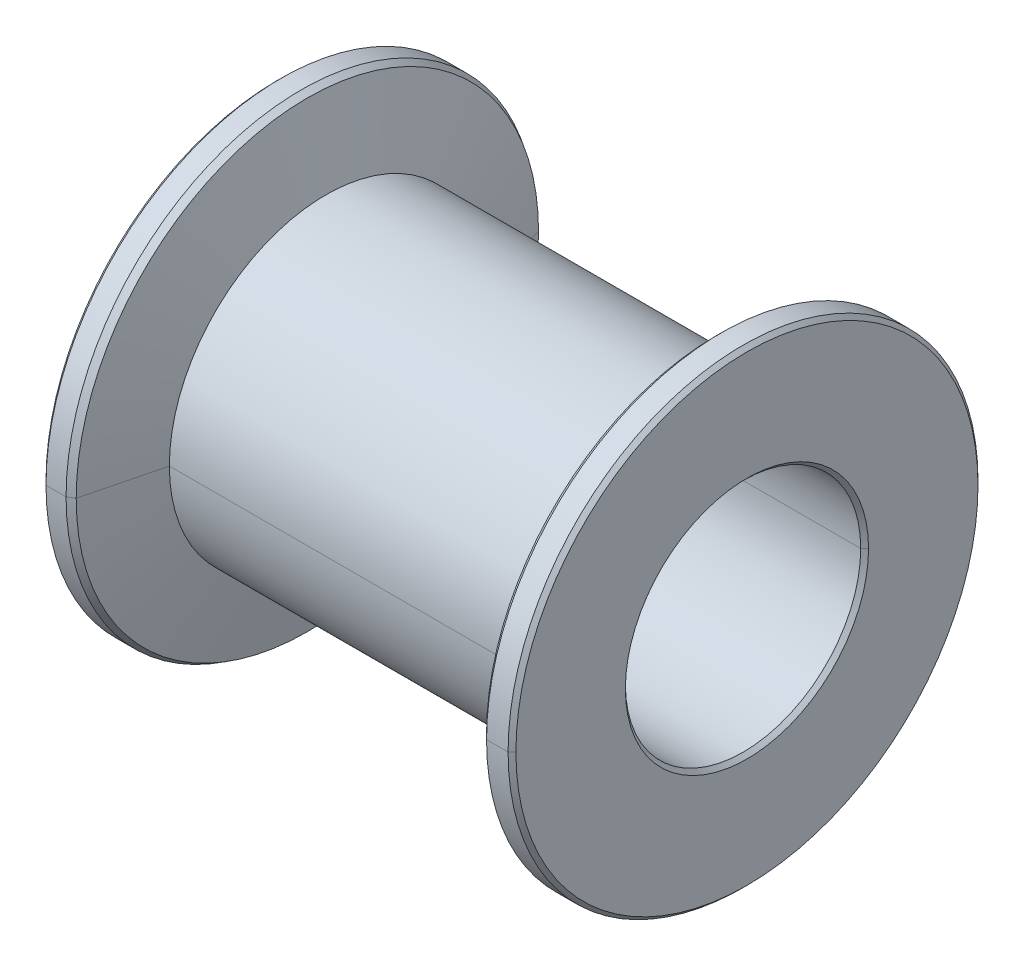
ISO-10303-21;
HEADER;
FILE_DESCRIPTION(('STEP AP214'),'2;1');
FILE_NAME('part.step','',(''),(''),'','','');
FILE_SCHEMA(('AUTOMOTIVE_DESIGN { 1 0 10303 214 1 1 1 1 }'));
ENDSEC;
DATA;
#1=APPLICATION_CONTEXT('core data for automotive mechanical design processes');
#2=APPLICATION_PROTOCOL_DEFINITION('international standard','automotive_design',2000,#1);
#3=PRODUCT_CONTEXT('',#1,'mechanical');
#4=PRODUCT('Part','Part','',(#3));
#5=PRODUCT_RELATED_PRODUCT_CATEGORY('part','',(#4));
#6=PRODUCT_DEFINITION_FORMATION('','',#4);
#7=PRODUCT_DEFINITION_CONTEXT('part definition',#1,'design');
#8=PRODUCT_DEFINITION('design','',#6,#7);
#9=PRODUCT_DEFINITION_SHAPE('','',#8);
#10=(LENGTH_UNIT() NAMED_UNIT(*) SI_UNIT(.MILLI.,.METRE.));
#11=(NAMED_UNIT(*) PLANE_ANGLE_UNIT() SI_UNIT($,.RADIAN.));
#12=(NAMED_UNIT(*) SI_UNIT($,.STERADIAN.) SOLID_ANGLE_UNIT());
#13=UNCERTAINTY_MEASURE_WITH_UNIT(LENGTH_MEASURE(1.E-05),#10,'distance_accuracy_value','');
#14=(GEOMETRIC_REPRESENTATION_CONTEXT(3) GLOBAL_UNCERTAINTY_ASSIGNED_CONTEXT((#13)) GLOBAL_UNIT_ASSIGNED_CONTEXT((#10,
#11,#12)) REPRESENTATION_CONTEXT('',''));
#15=CARTESIAN_POINT('',(0.,0.,0.));
#16=DIRECTION('',(0.,0.,1.));
#17=DIRECTION('',(1.,0.,0.));
#18=AXIS2_PLACEMENT_3D('',#15,#16,#17);
#19=CARTESIAN_POINT('',(5.9,0.,0.));
#20=DIRECTION('',(-1.,0.,0.));
#21=DIRECTION('',(0.,0.,1.));
#22=AXIS2_PLACEMENT_3D('',#19,#20,#21);
#23=CONICAL_SURFACE('',#22,6.,0.785398163397448);
#24=DIRECTION('',(-0.707106781186548,0.,-0.707106781186548));
#25=VECTOR('',#24,1.);
#26=CARTESIAN_POINT('',(5.9,0.,-6.));
#27=LINE('',#26,#25);
#28=CARTESIAN_POINT('',(6.,0.,-5.9));
#29=VERTEX_POINT('',#28);
#30=CARTESIAN_POINT('',(5.9,0.,-6.));
#31=VERTEX_POINT('',#30);
#32=EDGE_CURVE('E191',#29,#31,#27,.T.);
#33=ORIENTED_EDGE('',*,*,#32,.F.);
#34=CARTESIAN_POINT('',(6.,0.,0.));
#35=DIRECTION('',(1.,0.,0.));
#36=DIRECTION('',(0.,0.,1.));
#37=AXIS2_PLACEMENT_3D('',#34,#35,#36);
#38=CIRCLE('',#37,5.9);
#39=CARTESIAN_POINT('',(6.,0.,5.9));
#40=VERTEX_POINT('',#39);
#41=EDGE_CURVE('E183',#40,#29,#38,.T.);
#42=ORIENTED_EDGE('',*,*,#41,.F.);
#43=DIRECTION('',(-0.707106781186548,0.,0.707106781186548));
#44=VECTOR('',#43,1.);
#45=CARTESIAN_POINT('',(5.9,0.,6.));
#46=LINE('',#45,#44);
#47=CARTESIAN_POINT('',(5.9,0.,6.));
#48=VERTEX_POINT('',#47);
#49=EDGE_CURVE('E182',#40,#48,#46,.T.);
#50=ORIENTED_EDGE('',*,*,#49,.T.);
#51=CARTESIAN_POINT('',(5.9,0.,0.));
#52=DIRECTION('',(-1.,0.,0.));
#53=DIRECTION('',(0.,0.,1.));
#54=AXIS2_PLACEMENT_3D('',#51,#52,#53);
#55=CIRCLE('',#54,6.);
#56=EDGE_CURVE('E155',#31,#48,#55,.T.);
#57=ORIENTED_EDGE('',*,*,#56,.F.);
#58=EDGE_LOOP('',(#33,#42,#50,#57));
#59=FACE_BOUND('',#58,.T.);
#60=ADVANCED_FACE('F16',(#59),#23,.T.);
#61=CARTESIAN_POINT('',(6.,0.,0.));
#62=DIRECTION('',(1.,0.,0.));
#63=DIRECTION('',(0.,0.,-1.));
#64=AXIS2_PLACEMENT_3D('',#61,#62,#63);
#65=CONICAL_SURFACE('',#64,3.105,0.785398163397442);
#66=DIRECTION('',(0.707106781186552,0.,0.707106781186543));
#67=VECTOR('',#66,1.);
#68=CARTESIAN_POINT('',(6.,0.,3.105));
#69=LINE('',#68,#67);
#70=CARTESIAN_POINT('',(5.9,0.,3.005));
#71=VERTEX_POINT('',#70);
#72=CARTESIAN_POINT('',(6.,0.,3.105));
#73=VERTEX_POINT('',#72);
#74=EDGE_CURVE('E206',#71,#73,#69,.T.);
#75=ORIENTED_EDGE('',*,*,#74,.F.);
#76=CARTESIAN_POINT('',(5.9,0.,0.));
#77=DIRECTION('',(1.,0.,0.));
#78=DIRECTION('',(0.,0.,1.));
#79=AXIS2_PLACEMENT_3D('',#76,#77,#78);
#80=CIRCLE('',#79,3.005);
#81=CARTESIAN_POINT('',(5.9,0.,-3.005));
#82=VERTEX_POINT('',#81);
#83=EDGE_CURVE('E231',#82,#71,#80,.T.);
#84=ORIENTED_EDGE('',*,*,#83,.F.);
#85=DIRECTION('',(0.707106781186552,0.,-0.707106781186543));
#86=VECTOR('',#85,1.);
#87=CARTESIAN_POINT('',(6.,0.,-3.105));
#88=LINE('',#87,#86);
#89=CARTESIAN_POINT('',(6.,0.,-3.105));
#90=VERTEX_POINT('',#89);
#91=EDGE_CURVE('E214',#82,#90,#88,.T.);
#92=ORIENTED_EDGE('',*,*,#91,.T.);
#93=CARTESIAN_POINT('',(6.,0.,0.));
#94=DIRECTION('',(-1.,0.,0.));
#95=DIRECTION('',(0.,0.,1.));
#96=AXIS2_PLACEMENT_3D('',#93,#94,#95);
#97=CIRCLE('',#96,3.105);
#98=EDGE_CURVE('E168',#73,#90,#97,.T.);
#99=ORIENTED_EDGE('',*,*,#98,.F.);
#100=EDGE_LOOP('',(#75,#84,#92,#99));
#101=FACE_BOUND('',#100,.T.);
#102=ADVANCED_FACE('F18',(#101),#65,.F.);
#103=CARTESIAN_POINT('',(-5.9,0.,0.));
#104=DIRECTION('',(-1.,0.,0.));
#105=DIRECTION('',(0.,0.,1.));
#106=AXIS2_PLACEMENT_3D('',#103,#104,#105);
#107=CONICAL_SURFACE('',#106,3.005,0.785398163397462);
#108=DIRECTION('',(-0.707106781186538,0.,-0.707106781186557));
#109=VECTOR('',#108,1.);
#110=CARTESIAN_POINT('',(-5.9,0.,-3.005));
#111=LINE('',#110,#109);
#112=CARTESIAN_POINT('',(-5.9,0.,-3.005));
#113=VERTEX_POINT('',#112);
#114=CARTESIAN_POINT('',(-6.,0.,-3.105));
#115=VERTEX_POINT('',#114);
#116=EDGE_CURVE('E240',#113,#115,#111,.T.);
#117=ORIENTED_EDGE('',*,*,#116,.F.);
#118=CARTESIAN_POINT('',(-5.9,0.,0.));
#119=DIRECTION('',(-1.,0.,0.));
#120=DIRECTION('',(0.,0.,-1.));
#121=AXIS2_PLACEMENT_3D('',#118,#119,#120);
#122=CIRCLE('',#121,3.005);
#123=CARTESIAN_POINT('',(-5.9,0.,3.005));
#124=VERTEX_POINT('',#123);
#125=EDGE_CURVE('E234',#124,#113,#122,.T.);
#126=ORIENTED_EDGE('',*,*,#125,.F.);
#127=DIRECTION('',(-0.707106781186538,0.,0.707106781186557));
#128=VECTOR('',#127,1.);
#129=CARTESIAN_POINT('',(-5.9,0.,3.005));
#130=LINE('',#129,#128);
#131=CARTESIAN_POINT('',(-6.,0.,3.105));
#132=VERTEX_POINT('',#131);
#133=EDGE_CURVE('E248',#124,#132,#130,.T.);
#134=ORIENTED_EDGE('',*,*,#133,.T.);
#135=CARTESIAN_POINT('',(-6.,0.,0.));
#136=DIRECTION('',(1.,0.,0.));
#137=DIRECTION('',(0.,0.,-1.));
#138=AXIS2_PLACEMENT_3D('',#135,#136,#137);
#139=CIRCLE('',#138,3.105);
#140=EDGE_CURVE('E235',#115,#132,#139,.T.);
#141=ORIENTED_EDGE('',*,*,#140,.F.);
#142=EDGE_LOOP('',(#117,#126,#134,#141));
#143=FACE_BOUND('',#142,.T.);
#144=ADVANCED_FACE('F429',(#143),#107,.F.);
#145=CARTESIAN_POINT('',(-6.,0.,0.));
#146=DIRECTION('',(1.,0.,0.));
#147=DIRECTION('',(0.,0.,-1.));
#148=AXIS2_PLACEMENT_3D('',#145,#146,#147);
#149=CONICAL_SURFACE('',#148,5.9,0.785398163397443);
#150=DIRECTION('',(0.707106781186551,0.,0.707106781186544));
#151=VECTOR('',#150,1.);
#152=CARTESIAN_POINT('',(-6.,0.,5.9));
#153=LINE('',#152,#151);
#154=CARTESIAN_POINT('',(-6.,0.,5.9));
#155=VERTEX_POINT('',#154);
#156=CARTESIAN_POINT('',(-5.9,0.,6.));
#157=VERTEX_POINT('',#156);
#158=EDGE_CURVE('E215',#155,#157,#153,.T.);
#159=ORIENTED_EDGE('',*,*,#158,.F.);
#160=CARTESIAN_POINT('',(-6.,0.,0.));
#161=DIRECTION('',(-1.,0.,0.));
#162=DIRECTION('',(0.,0.,-1.));
#163=AXIS2_PLACEMENT_3D('',#160,#161,#162);
#164=CIRCLE('',#163,5.9);
#165=CARTESIAN_POINT('',(-6.,0.,-5.9));
#166=VERTEX_POINT('',#165);
#167=EDGE_CURVE('E259',#166,#155,#164,.T.);
#168=ORIENTED_EDGE('',*,*,#167,.F.);
#169=DIRECTION('',(0.707106781186551,0.,-0.707106781186544));
#170=VECTOR('',#169,1.);
#171=CARTESIAN_POINT('',(-6.,0.,-5.9));
#172=LINE('',#171,#170);
#173=CARTESIAN_POINT('',(-5.9,0.,-6.));
#174=VERTEX_POINT('',#173);
#175=EDGE_CURVE('E249',#166,#174,#172,.T.);
#176=ORIENTED_EDGE('',*,*,#175,.T.);
#177=CARTESIAN_POINT('',(-5.9,0.,0.));
#178=DIRECTION('',(1.,0.,0.));
#179=DIRECTION('',(0.,0.,-1.));
#180=AXIS2_PLACEMENT_3D('',#177,#178,#179);
#181=CIRCLE('',#180,6.);
#182=EDGE_CURVE('E10',#157,#174,#181,.T.);
#183=ORIENTED_EDGE('',*,*,#182,.F.);
#184=EDGE_LOOP('',(#159,#168,#176,#183));
#185=FACE_BOUND('',#184,.T.);
#186=ADVANCED_FACE('F671',(#185),#149,.T.);
#187=CARTESIAN_POINT('',(-5.38743685418726,0.,0.));
#188=DIRECTION('',(-1.,0.,0.));
#189=DIRECTION('',(0.,0.,1.));
#190=AXIS2_PLACEMENT_3D('',#187,#188,#189);
#191=CONICAL_SURFACE('',#190,6.,0.540419500270585);
#192=DIRECTION('',(-0.857492925712544,0.,-0.514495755427527));
#193=VECTOR('',#192,1.);
#194=CARTESIAN_POINT('',(-5.38743685418726,0.,-6.));
#195=LINE('',#194,#193);
#196=CARTESIAN_POINT('',(-5.22574643749637,0.,-5.90298574998546));
#197=VERTEX_POINT('',#196);
#198=CARTESIAN_POINT('',(-5.38743685418726,0.,-6.));
#199=VERTEX_POINT('',#198);
#200=EDGE_CURVE('E263',#197,#199,#195,.T.);
#201=ORIENTED_EDGE('',*,*,#200,.F.);
#202=CARTESIAN_POINT('',(-5.22574643749637,0.,0.));
#203=DIRECTION('',(1.,0.,0.));
#204=DIRECTION('',(0.,0.,-1.));
#205=AXIS2_PLACEMENT_3D('',#202,#203,#204);
#206=CIRCLE('',#205,5.90298574998546);
#207=CARTESIAN_POINT('',(-5.22574643749637,0.,5.90298574998546));
#208=VERTEX_POINT('',#207);
#209=EDGE_CURVE('E339',#208,#197,#206,.T.);
#210=ORIENTED_EDGE('',*,*,#209,.F.);
#211=DIRECTION('',(-0.857492925712544,0.,0.514495755427527));
#212=VECTOR('',#211,1.);
#213=CARTESIAN_POINT('',(-5.38743685418726,0.,6.));
#214=LINE('',#213,#212);
#215=CARTESIAN_POINT('',(-5.38743685418726,0.,6.));
#216=VERTEX_POINT('',#215);
#217=EDGE_CURVE('E271',#208,#216,#214,.T.);
#218=ORIENTED_EDGE('',*,*,#217,.T.);
#219=CARTESIAN_POINT('',(-5.38743685418726,0.,0.));
#220=DIRECTION('',(-1.,0.,0.));
#221=DIRECTION('',(0.,0.,1.));
#222=AXIS2_PLACEMENT_3D('',#219,#220,#221);
#223=CIRCLE('',#222,6.);
#224=EDGE_CURVE('E20',#199,#216,#223,.T.);
#225=ORIENTED_EDGE('',*,*,#224,.F.);
#226=EDGE_LOOP('',(#201,#210,#218,#225));
#227=FACE_BOUND('',#226,.T.);
#228=ADVANCED_FACE('F360',(#227),#191,.T.);
#229=CARTESIAN_POINT('',(5.21666666666667,0.,0.));
#230=DIRECTION('',(1.,0.,0.));
#231=DIRECTION('',(0.,0.,-1.));
#232=AXIS2_PLACEMENT_3D('',#229,#230,#231);
#233=CONICAL_SURFACE('',#232,5.86666666666667,0.785398163397432);
#234=DIRECTION('',(0.707106781186559,0.,0.707106781186536));
#235=VECTOR('',#234,1.);
#236=CARTESIAN_POINT('',(5.21666666666667,0.,5.86666666666667));
#237=LINE('',#236,#235);
#238=CARTESIAN_POINT('',(5.21666666666667,0.,5.86666666666668));
#239=VERTEX_POINT('',#238);
#240=CARTESIAN_POINT('',(5.35,0.,6.));
#241=VERTEX_POINT('',#240);
#242=EDGE_CURVE('E279',#239,#241,#237,.T.);
#243=ORIENTED_EDGE('',*,*,#242,.F.);
#244=CARTESIAN_POINT('',(5.21666666666667,0.,0.));
#245=DIRECTION('',(-1.,0.,0.));
#246=DIRECTION('',(0.,0.,1.));
#247=AXIS2_PLACEMENT_3D('',#244,#245,#246);
#248=CIRCLE('',#247,5.86666666666667);
#249=CARTESIAN_POINT('',(5.21666666666667,0.,-5.86666666666668));
#250=VERTEX_POINT('',#249);
#251=EDGE_CURVE('E334',#250,#239,#248,.T.);
#252=ORIENTED_EDGE('',*,*,#251,.F.);
#253=DIRECTION('',(0.707106781186559,0.,-0.707106781186536));
#254=VECTOR('',#253,1.);
#255=CARTESIAN_POINT('',(5.21666666666667,0.,-5.86666666666667));
#256=LINE('',#255,#254);
#257=CARTESIAN_POINT('',(5.35,0.,-6.));
#258=VERTEX_POINT('',#257);
#259=EDGE_CURVE('E284',#250,#258,#256,.T.);
#260=ORIENTED_EDGE('',*,*,#259,.T.);
#261=CARTESIAN_POINT('',(5.35,0.,0.));
#262=DIRECTION('',(1.,0.,0.));
#263=DIRECTION('',(0.,0.,-1.));
#264=AXIS2_PLACEMENT_3D('',#261,#262,#263);
#265=CIRCLE('',#264,6.);
#266=EDGE_CURVE('E167',#241,#258,#265,.T.);
#267=ORIENTED_EDGE('',*,*,#266,.F.);
#268=EDGE_LOOP('',(#243,#252,#260,#267));
#269=FACE_BOUND('',#268,.T.);
#270=ADVANCED_FACE('F651',(#269),#233,.T.);
#271=CARTESIAN_POINT('',(0.,0.,0.));
#272=DIRECTION('',(-1.,0.,0.));
#273=DIRECTION('',(0.,0.,1.));
#274=AXIS2_PLACEMENT_3D('',#271,#272,#273);
#275=CYLINDRICAL_SURFACE('',#274,6.);
#276=DIRECTION('',(-1.,0.,0.));
#277=VECTOR('',#276,1.);
#278=CARTESIAN_POINT('',(0.,0.,-6.));
#279=LINE('',#278,#277);
#280=EDGE_CURVE('E288',#199,#174,#279,.T.);
#281=ORIENTED_EDGE('',*,*,#280,.F.);
#282=ORIENTED_EDGE('',*,*,#224,.T.);
#283=DIRECTION('',(-1.,0.,0.));
#284=VECTOR('',#283,1.);
#285=CARTESIAN_POINT('',(0.,0.,6.));
#286=LINE('',#285,#284);
#287=EDGE_CURVE('E292',#216,#157,#286,.T.);
#288=ORIENTED_EDGE('',*,*,#287,.T.);
#289=ORIENTED_EDGE('',*,*,#182,.T.);
#290=EDGE_LOOP('',(#281,#282,#288,#289));
#291=FACE_BOUND('',#290,.T.);
#292=ADVANCED_FACE('F352',(#291),#275,.T.);
#293=CARTESIAN_POINT('',(-4.75,0.,0.));
#294=DIRECTION('',(-1.,0.,0.));
#295=DIRECTION('',(0.,0.,1.));
#296=AXIS2_PLACEMENT_3D('',#293,#294,#295);
#297=CONICAL_SURFACE('',#296,4.,1.32581766366803);
#298=DIRECTION('',(-0.242535625036333,0.,-0.970142500145332));
#299=VECTOR('',#298,1.);
#300=CARTESIAN_POINT('',(-4.75,0.,-4.));
#301=LINE('',#300,#299);
#302=CARTESIAN_POINT('',(-4.75,0.,-4.));
#303=VERTEX_POINT('',#302);
#304=EDGE_CURVE('E300',#303,#197,#301,.T.);
#305=ORIENTED_EDGE('',*,*,#304,.F.);
#306=CARTESIAN_POINT('',(-4.75,0.,0.));
#307=DIRECTION('',(-1.,0.,0.));
#308=DIRECTION('',(0.,0.,1.));
#309=AXIS2_PLACEMENT_3D('',#306,#307,#308);
#310=CIRCLE('',#309,4.);
#311=CARTESIAN_POINT('',(-4.75,0.,4.));
#312=VERTEX_POINT('',#311);
#313=EDGE_CURVE('E337',#303,#312,#310,.T.);
#314=ORIENTED_EDGE('',*,*,#313,.T.);
#315=DIRECTION('',(-0.242535625036333,0.,0.970142500145332));
#316=VECTOR('',#315,1.);
#317=CARTESIAN_POINT('',(-4.75,0.,4.));
#318=LINE('',#317,#316);
#319=EDGE_CURVE('E304',#312,#208,#318,.T.);
#320=ORIENTED_EDGE('',*,*,#319,.T.);
#321=ORIENTED_EDGE('',*,*,#209,.T.);
#322=EDGE_LOOP('',(#305,#314,#320,#321));
#323=FACE_BOUND('',#322,.T.);
#324=ADVANCED_FACE('F368',(#323),#297,.T.);
#325=CARTESIAN_POINT('',(0.,0.,0.));
#326=DIRECTION('',(-1.,0.,0.));
#327=DIRECTION('',(0.,0.,1.));
#328=AXIS2_PLACEMENT_3D('',#325,#326,#327);
#329=CYLINDRICAL_SURFACE('',#328,4.);
#330=DIRECTION('',(-1.,0.,0.));
#331=VECTOR('',#330,1.);
#332=CARTESIAN_POINT('',(0.,0.,-4.));
#333=LINE('',#332,#331);
#334=CARTESIAN_POINT('',(4.75,0.,-4.));
#335=VERTEX_POINT('',#334);
#336=EDGE_CURVE('E221',#335,#303,#333,.T.);
#337=ORIENTED_EDGE('',*,*,#336,.F.);
#338=CARTESIAN_POINT('',(4.75,0.,0.));
#339=DIRECTION('',(-1.,0.,0.));
#340=DIRECTION('',(0.,0.,1.));
#341=AXIS2_PLACEMENT_3D('',#338,#339,#340);
#342=CIRCLE('',#341,4.);
#343=CARTESIAN_POINT('',(4.75,0.,4.));
#344=VERTEX_POINT('',#343);
#345=EDGE_CURVE('E39',#335,#344,#342,.T.);
#346=ORIENTED_EDGE('',*,*,#345,.T.);
#347=DIRECTION('',(-1.,0.,0.));
#348=VECTOR('',#347,1.);
#349=CARTESIAN_POINT('',(0.,0.,4.));
#350=LINE('',#349,#348);
#351=EDGE_CURVE('E225',#344,#312,#350,.T.);
#352=ORIENTED_EDGE('',*,*,#351,.T.);
#353=ORIENTED_EDGE('',*,*,#313,.F.);
#354=EDGE_LOOP('',(#337,#346,#352,#353));
#355=FACE_BOUND('',#354,.T.);
#356=ADVANCED_FACE('F370',(#355),#329,.T.);
#357=CARTESIAN_POINT('',(5.25,0.,0.));
#358=DIRECTION('',(1.,0.,0.));
#359=DIRECTION('',(0.,0.,-1.));
#360=AXIS2_PLACEMENT_3D('',#357,#358,#359);
#361=CONICAL_SURFACE('',#360,6.,1.32581766366803);
#362=DIRECTION('',(0.242535625036334,0.,0.970142500145332));
#363=VECTOR('',#362,1.);
#364=CARTESIAN_POINT('',(5.25,0.,6.));
#365=LINE('',#364,#363);
#366=EDGE_CURVE('E316',#344,#239,#365,.T.);
#367=ORIENTED_EDGE('',*,*,#366,.F.);
#368=ORIENTED_EDGE('',*,*,#345,.F.);
#369=DIRECTION('',(0.242535625036334,0.,-0.970142500145332));
#370=VECTOR('',#369,1.);
#371=CARTESIAN_POINT('',(5.25,0.,-6.));
#372=LINE('',#371,#370);
#373=EDGE_CURVE('E201',#335,#250,#372,.T.);
#374=ORIENTED_EDGE('',*,*,#373,.T.);
#375=ORIENTED_EDGE('',*,*,#251,.T.);
#376=EDGE_LOOP('',(#367,#368,#374,#375));
#377=FACE_BOUND('',#376,.T.);
#378=ADVANCED_FACE('F454',(#377),#361,.T.);
#379=CARTESIAN_POINT('',(0.,0.,0.));
#380=DIRECTION('',(-1.,0.,0.));
#381=DIRECTION('',(0.,0.,1.));
#382=AXIS2_PLACEMENT_3D('',#379,#380,#381);
#383=CYLINDRICAL_SURFACE('',#382,6.);
#384=DIRECTION('',(-1.,0.,0.));
#385=VECTOR('',#384,1.);
#386=CARTESIAN_POINT('',(0.,0.,-6.));
#387=LINE('',#386,#385);
#388=EDGE_CURVE('E161',#31,#258,#387,.T.);
#389=ORIENTED_EDGE('',*,*,#388,.F.);
#390=ORIENTED_EDGE('',*,*,#56,.T.);
#391=DIRECTION('',(-1.,0.,0.));
#392=VECTOR('',#391,1.);
#393=CARTESIAN_POINT('',(0.,0.,6.));
#394=LINE('',#393,#392);
#395=EDGE_CURVE('E158',#48,#241,#394,.T.);
#396=ORIENTED_EDGE('',*,*,#395,.T.);
#397=ORIENTED_EDGE('',*,*,#266,.T.);
#398=EDGE_LOOP('',(#389,#390,#396,#397));
#399=FACE_BOUND('',#398,.T.);
#400=ADVANCED_FACE('F157',(#399),#383,.T.);
#401=CARTESIAN_POINT('',(6.,0.,-3.005));
#402=DIRECTION('',(-1.,0.,0.));
#403=DIRECTION('',(0.,0.,1.));
#404=AXIS2_PLACEMENT_3D('',#401,#402,#403);
#405=PLANE('',#404);
#406=CARTESIAN_POINT('',(6.,0.,0.));
#407=DIRECTION('',(-1.,0.,0.));
#408=DIRECTION('',(0.,0.,1.));
#409=AXIS2_PLACEMENT_3D('',#406,#407,#408);
#410=CIRCLE('',#409,3.105);
#411=EDGE_CURVE('E210',#90,#73,#410,.T.);
#412=ORIENTED_EDGE('',*,*,#411,.T.);
#413=ORIENTED_EDGE('',*,*,#98,.T.);
#414=EDGE_LOOP('',(#412,#413));
#415=FACE_BOUND('',#414,.T.);
#416=ORIENTED_EDGE('',*,*,#41,.T.);
#417=CARTESIAN_POINT('',(6.,0.,0.));
#418=DIRECTION('',(1.,0.,0.));
#419=DIRECTION('',(0.,0.,1.));
#420=AXIS2_PLACEMENT_3D('',#417,#418,#419);
#421=CIRCLE('',#420,5.9);
#422=EDGE_CURVE('E198',#29,#40,#421,.T.);
#423=ORIENTED_EDGE('',*,*,#422,.T.);
#424=EDGE_LOOP('',(#416,#423));
#425=FACE_BOUND('',#424,.T.);
#426=ADVANCED_FACE('F444',(#415,#425),#405,.F.);
#427=CARTESIAN_POINT('',(0.,0.,0.));
#428=DIRECTION('',(-1.,0.,0.));
#429=DIRECTION('',(0.,0.,1.));
#430=AXIS2_PLACEMENT_3D('',#427,#428,#429);
#431=CYLINDRICAL_SURFACE('',#430,3.005);
#432=DIRECTION('',(-1.,0.,0.));
#433=VECTOR('',#432,1.);
#434=CARTESIAN_POINT('',(0.,0.,-3.005));
#435=LINE('',#434,#433);
#436=EDGE_CURVE('E179',#82,#113,#435,.T.);
#437=ORIENTED_EDGE('',*,*,#436,.F.);
#438=ORIENTED_EDGE('',*,*,#83,.T.);
#439=DIRECTION('',(-1.,0.,0.));
#440=VECTOR('',#439,1.);
#441=CARTESIAN_POINT('',(0.,0.,3.005));
#442=LINE('',#441,#440);
#443=EDGE_CURVE('E239',#71,#124,#442,.T.);
#444=ORIENTED_EDGE('',*,*,#443,.T.);
#445=ORIENTED_EDGE('',*,*,#125,.T.);
#446=EDGE_LOOP('',(#437,#438,#444,#445));
#447=FACE_BOUND('',#446,.T.);
#448=ADVANCED_FACE('F438',(#447),#431,.F.);
#449=CARTESIAN_POINT('',(-6.,0.,-6.));
#450=DIRECTION('',(1.,0.,0.));
#451=DIRECTION('',(0.,1.,0.));
#452=AXIS2_PLACEMENT_3D('',#449,#450,#451);
#453=PLANE('',#452);
#454=CARTESIAN_POINT('',(-6.,0.,0.));
#455=DIRECTION('',(1.,0.,0.));
#456=DIRECTION('',(0.,0.,-1.));
#457=AXIS2_PLACEMENT_3D('',#454,#455,#456);
#458=CIRCLE('',#457,3.105);
#459=EDGE_CURVE('E244',#132,#115,#458,.T.);
#460=ORIENTED_EDGE('',*,*,#459,.T.);
#461=ORIENTED_EDGE('',*,*,#140,.T.);
#462=EDGE_LOOP('',(#460,#461));
#463=FACE_BOUND('',#462,.T.);
#464=ORIENTED_EDGE('',*,*,#167,.T.);
#465=CARTESIAN_POINT('',(-6.,0.,0.));
#466=DIRECTION('',(-1.,0.,0.));
#467=DIRECTION('',(0.,0.,-1.));
#468=AXIS2_PLACEMENT_3D('',#465,#466,#467);
#469=CIRCLE('',#468,5.9);
#470=EDGE_CURVE('E220',#155,#166,#469,.T.);
#471=ORIENTED_EDGE('',*,*,#470,.T.);
#472=EDGE_LOOP('',(#464,#471));
#473=FACE_BOUND('',#472,.T.);
#474=ADVANCED_FACE('F421',(#463,#473),#453,.F.);
#475=CARTESIAN_POINT('',(0.,0.,0.));
#476=DIRECTION('',(-1.,0.,0.));
#477=DIRECTION('',(0.,0.,1.));
#478=AXIS2_PLACEMENT_3D('',#475,#476,#477);
#479=CYLINDRICAL_SURFACE('',#478,3.005);
#480=CARTESIAN_POINT('',(5.9,0.,0.));
#481=DIRECTION('',(1.,0.,0.));
#482=DIRECTION('',(0.,0.,1.));
#483=AXIS2_PLACEMENT_3D('',#480,#481,#482);
#484=CIRCLE('',#483,3.005);
#485=EDGE_CURVE('E188',#71,#82,#484,.T.);
#486=ORIENTED_EDGE('',*,*,#485,.T.);
#487=ORIENTED_EDGE('',*,*,#436,.T.);
#488=CARTESIAN_POINT('',(-5.9,0.,0.));
#489=DIRECTION('',(-1.,0.,0.));
#490=DIRECTION('',(0.,0.,-1.));
#491=AXIS2_PLACEMENT_3D('',#488,#489,#490);
#492=CIRCLE('',#491,3.005);
#493=EDGE_CURVE('E230',#113,#124,#492,.T.);
#494=ORIENTED_EDGE('',*,*,#493,.T.);
#495=ORIENTED_EDGE('',*,*,#443,.F.);
#496=EDGE_LOOP('',(#486,#487,#494,#495));
#497=FACE_BOUND('',#496,.T.);
#498=ADVANCED_FACE('F432',(#497),#479,.F.);
#499=CARTESIAN_POINT('',(0.,0.,0.));
#500=DIRECTION('',(-1.,0.,0.));
#501=DIRECTION('',(0.,0.,1.));
#502=AXIS2_PLACEMENT_3D('',#499,#500,#501);
#503=CYLINDRICAL_SURFACE('',#502,6.);
#504=CARTESIAN_POINT('',(5.9,0.,0.));
#505=DIRECTION('',(-1.,0.,0.));
#506=DIRECTION('',(0.,0.,1.));
#507=AXIS2_PLACEMENT_3D('',#504,#505,#506);
#508=CIRCLE('',#507,6.);
#509=EDGE_CURVE('E173',#48,#31,#508,.T.);
#510=ORIENTED_EDGE('',*,*,#509,.T.);
#511=ORIENTED_EDGE('',*,*,#388,.T.);
#512=CARTESIAN_POINT('',(5.35,0.,0.));
#513=DIRECTION('',(1.,0.,0.));
#514=DIRECTION('',(0.,0.,-1.));
#515=AXIS2_PLACEMENT_3D('',#512,#513,#514);
#516=CIRCLE('',#515,6.);
#517=EDGE_CURVE('E176',#258,#241,#516,.T.);
#518=ORIENTED_EDGE('',*,*,#517,.T.);
#519=ORIENTED_EDGE('',*,*,#395,.F.);
#520=EDGE_LOOP('',(#510,#511,#518,#519));
#521=FACE_BOUND('',#520,.T.);
#522=ADVANCED_FACE('F171',(#521),#503,.T.);
#523=CARTESIAN_POINT('',(5.25,0.,0.));
#524=DIRECTION('',(1.,0.,0.));
#525=DIRECTION('',(0.,0.,-1.));
#526=AXIS2_PLACEMENT_3D('',#523,#524,#525);
#527=CONICAL_SURFACE('',#526,6.,1.32581766366803);
#528=CARTESIAN_POINT('',(4.75,0.,0.));
#529=DIRECTION('',(-1.,0.,0.));
#530=DIRECTION('',(0.,0.,1.));
#531=AXIS2_PLACEMENT_3D('',#528,#529,#530);
#532=CIRCLE('',#531,4.);
#533=EDGE_CURVE('E226',#344,#335,#532,.T.);
#534=ORIENTED_EDGE('',*,*,#533,.F.);
#535=ORIENTED_EDGE('',*,*,#366,.T.);
#536=CARTESIAN_POINT('',(5.21666666666667,0.,0.));
#537=DIRECTION('',(-1.,0.,0.));
#538=DIRECTION('',(0.,0.,1.));
#539=AXIS2_PLACEMENT_3D('',#536,#537,#538);
#540=CIRCLE('',#539,5.86666666666667);
#541=EDGE_CURVE('E275',#239,#250,#540,.T.);
#542=ORIENTED_EDGE('',*,*,#541,.T.);
#543=ORIENTED_EDGE('',*,*,#373,.F.);
#544=EDGE_LOOP('',(#534,#535,#542,#543));
#545=FACE_BOUND('',#544,.T.);
#546=ADVANCED_FACE('F375',(#545),#527,.T.);
#547=CARTESIAN_POINT('',(0.,0.,0.));
#548=DIRECTION('',(-1.,0.,0.));
#549=DIRECTION('',(0.,0.,1.));
#550=AXIS2_PLACEMENT_3D('',#547,#548,#549);
#551=CYLINDRICAL_SURFACE('',#550,4.);
#552=ORIENTED_EDGE('',*,*,#533,.T.);
#553=ORIENTED_EDGE('',*,*,#336,.T.);
#554=CARTESIAN_POINT('',(-4.75,0.,0.));
#555=DIRECTION('',(-1.,0.,0.));
#556=DIRECTION('',(0.,0.,1.));
#557=AXIS2_PLACEMENT_3D('',#554,#555,#556);
#558=CIRCLE('',#557,4.);
#559=EDGE_CURVE('E296',#312,#303,#558,.T.);
#560=ORIENTED_EDGE('',*,*,#559,.F.);
#561=ORIENTED_EDGE('',*,*,#351,.F.);
#562=EDGE_LOOP('',(#552,#553,#560,#561));
#563=FACE_BOUND('',#562,.T.);
#564=ADVANCED_FACE('F373',(#563),#551,.T.);
#565=CARTESIAN_POINT('',(-4.75,0.,0.));
#566=DIRECTION('',(-1.,0.,0.));
#567=DIRECTION('',(0.,0.,1.));
#568=AXIS2_PLACEMENT_3D('',#565,#566,#567);
#569=CONICAL_SURFACE('',#568,4.,1.32581766366803);
#570=ORIENTED_EDGE('',*,*,#559,.T.);
#571=ORIENTED_EDGE('',*,*,#304,.T.);
#572=CARTESIAN_POINT('',(-5.22574643749637,0.,0.));
#573=DIRECTION('',(1.,0.,0.));
#574=DIRECTION('',(0.,0.,-1.));
#575=AXIS2_PLACEMENT_3D('',#572,#573,#574);
#576=CIRCLE('',#575,5.90298574998546);
#577=EDGE_CURVE('E253',#197,#208,#576,.T.);
#578=ORIENTED_EDGE('',*,*,#577,.T.);
#579=ORIENTED_EDGE('',*,*,#319,.F.);
#580=EDGE_LOOP('',(#570,#571,#578,#579));
#581=FACE_BOUND('',#580,.T.);
#582=ADVANCED_FACE('F366',(#581),#569,.T.);
#583=CARTESIAN_POINT('',(0.,0.,0.));
#584=DIRECTION('',(-1.,0.,0.));
#585=DIRECTION('',(0.,0.,1.));
#586=AXIS2_PLACEMENT_3D('',#583,#584,#585);
#587=CYLINDRICAL_SURFACE('',#586,6.);
#588=CARTESIAN_POINT('',(-5.38743685418726,0.,0.));
#589=DIRECTION('',(-1.,0.,0.));
#590=DIRECTION('',(0.,0.,1.));
#591=AXIS2_PLACEMENT_3D('',#588,#589,#590);
#592=CIRCLE('',#591,6.);
#593=EDGE_CURVE('E267',#216,#199,#592,.T.);
#594=ORIENTED_EDGE('',*,*,#593,.T.);
#595=ORIENTED_EDGE('',*,*,#280,.T.);
#596=CARTESIAN_POINT('',(-5.9,0.,0.));
#597=DIRECTION('',(1.,0.,0.));
#598=DIRECTION('',(0.,0.,-1.));
#599=AXIS2_PLACEMENT_3D('',#596,#597,#598);
#600=CIRCLE('',#599,6.);
#601=EDGE_CURVE('E219',#174,#157,#600,.T.);
#602=ORIENTED_EDGE('',*,*,#601,.T.);
#603=ORIENTED_EDGE('',*,*,#287,.F.);
#604=EDGE_LOOP('',(#594,#595,#602,#603));
#605=FACE_BOUND('',#604,.T.);
#606=ADVANCED_FACE('F356',(#605),#587,.T.);
#607=CARTESIAN_POINT('',(5.21666666666667,0.,0.));
#608=DIRECTION('',(1.,0.,0.));
#609=DIRECTION('',(0.,0.,-1.));
#610=AXIS2_PLACEMENT_3D('',#607,#608,#609);
#611=CONICAL_SURFACE('',#610,5.86666666666667,0.785398163397432);
#612=ORIENTED_EDGE('',*,*,#541,.F.);
#613=ORIENTED_EDGE('',*,*,#242,.T.);
#614=ORIENTED_EDGE('',*,*,#517,.F.);
#615=ORIENTED_EDGE('',*,*,#259,.F.);
#616=EDGE_LOOP('',(#612,#613,#614,#615));
#617=FACE_BOUND('',#616,.T.);
#618=ADVANCED_FACE('F474',(#617),#611,.T.);
#619=CARTESIAN_POINT('',(-5.38743685418726,0.,0.));
#620=DIRECTION('',(-1.,0.,0.));
#621=DIRECTION('',(0.,0.,1.));
#622=AXIS2_PLACEMENT_3D('',#619,#620,#621);
#623=CONICAL_SURFACE('',#622,6.,0.540419500270585);
#624=ORIENTED_EDGE('',*,*,#577,.F.);
#625=ORIENTED_EDGE('',*,*,#200,.T.);
#626=ORIENTED_EDGE('',*,*,#593,.F.);
#627=ORIENTED_EDGE('',*,*,#217,.F.);
#628=EDGE_LOOP('',(#624,#625,#626,#627));
#629=FACE_BOUND('',#628,.T.);
#630=ADVANCED_FACE('F363',(#629),#623,.T.);
#631=CARTESIAN_POINT('',(-6.,0.,0.));
#632=DIRECTION('',(1.,0.,0.));
#633=DIRECTION('',(0.,0.,-1.));
#634=AXIS2_PLACEMENT_3D('',#631,#632,#633);
#635=CONICAL_SURFACE('',#634,5.9,0.785398163397443);
#636=ORIENTED_EDGE('',*,*,#470,.F.);
#637=ORIENTED_EDGE('',*,*,#158,.T.);
#638=ORIENTED_EDGE('',*,*,#601,.F.);
#639=ORIENTED_EDGE('',*,*,#175,.F.);
#640=EDGE_LOOP('',(#636,#637,#638,#639));
#641=FACE_BOUND('',#640,.T.);
#642=ADVANCED_FACE('F466',(#641),#635,.T.);
#643=CARTESIAN_POINT('',(-5.9,0.,0.));
#644=DIRECTION('',(-1.,0.,0.));
#645=DIRECTION('',(0.,0.,1.));
#646=AXIS2_PLACEMENT_3D('',#643,#644,#645);
#647=CONICAL_SURFACE('',#646,3.005,0.785398163397462);
#648=ORIENTED_EDGE('',*,*,#493,.F.);
#649=ORIENTED_EDGE('',*,*,#116,.T.);
#650=ORIENTED_EDGE('',*,*,#459,.F.);
#651=ORIENTED_EDGE('',*,*,#133,.F.);
#652=EDGE_LOOP('',(#648,#649,#650,#651));
#653=FACE_BOUND('',#652,.T.);
#654=ADVANCED_FACE('F427',(#653),#647,.F.);
#655=CARTESIAN_POINT('',(6.,0.,0.));
#656=DIRECTION('',(1.,0.,0.));
#657=DIRECTION('',(0.,0.,-1.));
#658=AXIS2_PLACEMENT_3D('',#655,#656,#657);
#659=CONICAL_SURFACE('',#658,3.105,0.785398163397442);
#660=ORIENTED_EDGE('',*,*,#485,.F.);
#661=ORIENTED_EDGE('',*,*,#74,.T.);
#662=ORIENTED_EDGE('',*,*,#411,.F.);
#663=ORIENTED_EDGE('',*,*,#91,.F.);
#664=EDGE_LOOP('',(#660,#661,#662,#663));
#665=FACE_BOUND('',#664,.T.);
#666=ADVANCED_FACE('F441',(#665),#659,.F.);
#667=CARTESIAN_POINT('',(5.9,0.,0.));
#668=DIRECTION('',(-1.,0.,0.));
#669=DIRECTION('',(0.,0.,1.));
#670=AXIS2_PLACEMENT_3D('',#667,#668,#669);
#671=CONICAL_SURFACE('',#670,6.,0.785398163397448);
#672=ORIENTED_EDGE('',*,*,#422,.F.);
#673=ORIENTED_EDGE('',*,*,#32,.T.);
#674=ORIENTED_EDGE('',*,*,#509,.F.);
#675=ORIENTED_EDGE('',*,*,#49,.F.);
#676=EDGE_LOOP('',(#672,#673,#674,#675));
#677=FACE_BOUND('',#676,.T.);
#678=ADVANCED_FACE('F190',(#677),#671,.T.);
#679=CLOSED_SHELL('',(#60,#102,#144,#186,#228,#270,#292,#324,#356,#378,#400,#426,#448,#474,#498,
#522,#546,#564,#582,#606,#618,#630,#642,#654,#666,#678));
#680=MANIFOLD_SOLID_BREP('B1',#679);
#681=ADVANCED_BREP_SHAPE_REPRESENTATION('',(#18,#680),#14);
#682=SHAPE_DEFINITION_REPRESENTATION(#9,#681);
ENDSEC;
END-ISO-10303-21;
